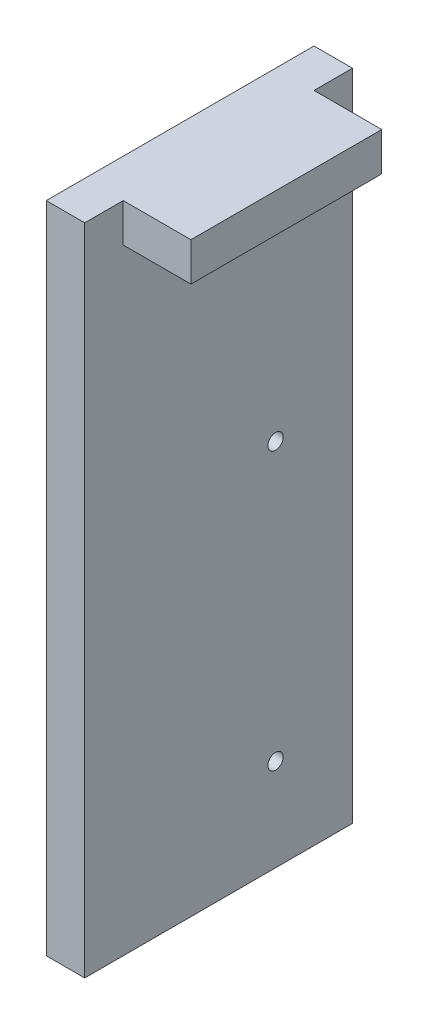
ISO-10303-21;
HEADER;
FILE_DESCRIPTION(('STEP AP214'),'2;1');
FILE_NAME('part.step','',(''),(''),'','','');
FILE_SCHEMA(('AUTOMOTIVE_DESIGN { 1 0 10303 214 1 1 1 1 }'));
ENDSEC;
DATA;
#1=APPLICATION_CONTEXT('core data for automotive mechanical design processes');
#2=APPLICATION_PROTOCOL_DEFINITION('international standard','automotive_design',2000,#1);
#3=PRODUCT_CONTEXT('',#1,'mechanical');
#4=PRODUCT('Part','Part','',(#3));
#5=PRODUCT_RELATED_PRODUCT_CATEGORY('part','',(#4));
#6=PRODUCT_DEFINITION_FORMATION('','',#4);
#7=PRODUCT_DEFINITION_CONTEXT('part definition',#1,'design');
#8=PRODUCT_DEFINITION('design','',#6,#7);
#9=PRODUCT_DEFINITION_SHAPE('','',#8);
#10=(LENGTH_UNIT() NAMED_UNIT(*) SI_UNIT(.MILLI.,.METRE.));
#11=(NAMED_UNIT(*) PLANE_ANGLE_UNIT() SI_UNIT($,.RADIAN.));
#12=(NAMED_UNIT(*) SI_UNIT($,.STERADIAN.) SOLID_ANGLE_UNIT());
#13=UNCERTAINTY_MEASURE_WITH_UNIT(LENGTH_MEASURE(1.E-05),#10,'distance_accuracy_value','');
#14=(GEOMETRIC_REPRESENTATION_CONTEXT(3) GLOBAL_UNCERTAINTY_ASSIGNED_CONTEXT((#13)) GLOBAL_UNIT_ASSIGNED_CONTEXT((#10,
#11,#12)) REPRESENTATION_CONTEXT('',''));
#15=CARTESIAN_POINT('',(0.,0.,0.));
#16=DIRECTION('',(0.,0.,1.));
#17=DIRECTION('',(1.,0.,0.));
#18=AXIS2_PLACEMENT_3D('',#15,#16,#17);
#19=CARTESIAN_POINT('',(1.5875,13.49375,-5.5245));
#20=DIRECTION('',(0.,0.,1.));
#21=DIRECTION('',(0.,-1.,0.));
#22=AXIS2_PLACEMENT_3D('',#19,#20,#21);
#23=PLANE('',#22);
#24=DIRECTION('',(0.,1.,0.));
#25=VECTOR('',#24,1.);
#26=CARTESIAN_POINT('',(0.,13.49375,-5.5245));
#27=LINE('',#26,#25);
#28=CARTESIAN_POINT('',(0.,-13.49375,-5.5245));
#29=VERTEX_POINT('',#28);
#30=CARTESIAN_POINT('',(0.,13.49375,-5.5245));
#31=VERTEX_POINT('',#30);
#32=EDGE_CURVE('E118',#29,#31,#27,.T.);
#33=ORIENTED_EDGE('',*,*,#32,.T.);
#34=DIRECTION('',(-1.,0.,0.));
#35=VECTOR('',#34,1.);
#36=CARTESIAN_POINT('',(1.5875,13.49375,-5.5245));
#37=LINE('',#36,#35);
#38=CARTESIAN_POINT('',(1.5875,13.49375,-5.5245));
#39=VERTEX_POINT('',#38);
#40=EDGE_CURVE('E11',#39,#31,#37,.T.);
#41=ORIENTED_EDGE('',*,*,#40,.F.);
#42=DIRECTION('',(0.,1.,0.));
#43=VECTOR('',#42,1.);
#44=CARTESIAN_POINT('',(1.5875,13.49375,-5.5245));
#45=LINE('',#44,#43);
#46=CARTESIAN_POINT('',(1.5875,-13.49375,-5.5245));
#47=VERTEX_POINT('',#46);
#48=EDGE_CURVE('E127',#47,#39,#45,.T.);
#49=ORIENTED_EDGE('',*,*,#48,.F.);
#50=DIRECTION('',(-1.,0.,0.));
#51=VECTOR('',#50,1.);
#52=CARTESIAN_POINT('',(1.5875,-13.49375,-5.5245));
#53=LINE('',#52,#51);
#54=EDGE_CURVE('E137',#47,#29,#53,.T.);
#55=ORIENTED_EDGE('',*,*,#54,.T.);
#56=EDGE_LOOP('',(#33,#41,#49,#55));
#57=FACE_BOUND('',#56,.T.);
#58=ADVANCED_FACE('F33',(#57),#23,.F.);
#59=CARTESIAN_POINT('',(1.5875,13.49375,5.5245));
#60=DIRECTION('',(0.,-1.,0.));
#61=DIRECTION('',(0.,0.,-1.));
#62=AXIS2_PLACEMENT_3D('',#59,#60,#61);
#63=PLANE('',#62);
#64=DIRECTION('',(0.,0.,1.));
#65=VECTOR('',#64,1.);
#66=CARTESIAN_POINT('',(0.,13.49375,5.5245));
#67=LINE('',#66,#65);
#68=CARTESIAN_POINT('',(0.,13.49375,5.5245));
#69=VERTEX_POINT('',#68);
#70=EDGE_CURVE('E121',#31,#69,#67,.T.);
#71=ORIENTED_EDGE('',*,*,#70,.T.);
#72=DIRECTION('',(-1.,0.,0.));
#73=VECTOR('',#72,1.);
#74=CARTESIAN_POINT('',(1.5875,13.49375,5.5245));
#75=LINE('',#74,#73);
#76=CARTESIAN_POINT('',(1.5875,13.49375,5.5245));
#77=VERTEX_POINT('',#76);
#78=EDGE_CURVE('E40',#77,#69,#75,.T.);
#79=ORIENTED_EDGE('',*,*,#78,.F.);
#80=DIRECTION('',(0.,0.,1.));
#81=VECTOR('',#80,1.);
#82=CARTESIAN_POINT('',(1.5875,13.49375,5.5245));
#83=LINE('',#82,#81);
#84=CARTESIAN_POINT('',(1.5875,13.49375,3.937));
#85=VERTEX_POINT('',#84);
#86=EDGE_CURVE('E130',#85,#77,#83,.T.);
#87=ORIENTED_EDGE('',*,*,#86,.F.);
#88=DIRECTION('',(-1.,0.,0.));
#89=VECTOR('',#88,1.);
#90=CARTESIAN_POINT('',(4.3815,13.49375,3.937));
#91=LINE('',#90,#89);
#92=CARTESIAN_POINT('',(4.3815,13.49375,3.937));
#93=VERTEX_POINT('',#92);
#94=EDGE_CURVE('E102',#93,#85,#91,.T.);
#95=ORIENTED_EDGE('',*,*,#94,.F.);
#96=DIRECTION('',(0.,0.,1.));
#97=VECTOR('',#96,1.);
#98=CARTESIAN_POINT('',(4.3815,13.49375,3.937));
#99=LINE('',#98,#97);
#100=CARTESIAN_POINT('',(4.3815,13.49375,-3.937));
#101=VERTEX_POINT('',#100);
#102=EDGE_CURVE('E96',#101,#93,#99,.T.);
#103=ORIENTED_EDGE('',*,*,#102,.F.);
#104=DIRECTION('',(-1.,0.,0.));
#105=VECTOR('',#104,1.);
#106=CARTESIAN_POINT('',(4.3815,13.49375,-3.937));
#107=LINE('',#106,#105);
#108=CARTESIAN_POINT('',(1.5875,13.49375,-3.937));
#109=VERTEX_POINT('',#108);
#110=EDGE_CURVE('E100',#101,#109,#107,.T.);
#111=ORIENTED_EDGE('',*,*,#110,.T.);
#112=EDGE_CURVE('E132',#39,#109,#83,.T.);
#113=ORIENTED_EDGE('',*,*,#112,.F.);
#114=ORIENTED_EDGE('',*,*,#40,.T.);
#115=EDGE_LOOP('',(#71,#79,#87,#95,#103,#111,#113,#114));
#116=FACE_BOUND('',#115,.T.);
#117=ADVANCED_FACE('F98',(#116),#63,.F.);
#118=CARTESIAN_POINT('',(1.5875,13.49375,5.5245));
#119=DIRECTION('',(0.,0.,-1.));
#120=DIRECTION('',(0.,1.,0.));
#121=AXIS2_PLACEMENT_3D('',#118,#119,#120);
#122=PLANE('',#121);
#123=DIRECTION('',(0.,-1.,0.));
#124=VECTOR('',#123,1.);
#125=CARTESIAN_POINT('',(0.,13.49375,5.5245));
#126=LINE('',#125,#124);
#127=CARTESIAN_POINT('',(0.,-13.49375,5.5245));
#128=VERTEX_POINT('',#127);
#129=EDGE_CURVE('E140',#69,#128,#126,.T.);
#130=ORIENTED_EDGE('',*,*,#129,.T.);
#131=DIRECTION('',(-1.,0.,0.));
#132=VECTOR('',#131,1.);
#133=CARTESIAN_POINT('',(1.5875,-13.49375,5.5245));
#134=LINE('',#133,#132);
#135=CARTESIAN_POINT('',(1.5875,-13.49375,5.5245));
#136=VERTEX_POINT('',#135);
#137=EDGE_CURVE('E145',#136,#128,#134,.T.);
#138=ORIENTED_EDGE('',*,*,#137,.F.);
#139=DIRECTION('',(0.,-1.,0.));
#140=VECTOR('',#139,1.);
#141=CARTESIAN_POINT('',(1.5875,13.49375,5.5245));
#142=LINE('',#141,#140);
#143=EDGE_CURVE('E134',#77,#136,#142,.T.);
#144=ORIENTED_EDGE('',*,*,#143,.F.);
#145=ORIENTED_EDGE('',*,*,#78,.T.);
#146=EDGE_LOOP('',(#130,#138,#144,#145));
#147=FACE_BOUND('',#146,.T.);
#148=ADVANCED_FACE('F152',(#147),#122,.F.);
#149=CARTESIAN_POINT('',(1.5875,-13.49375,5.5245));
#150=DIRECTION('',(0.,1.,0.));
#151=DIRECTION('',(0.,0.,1.));
#152=AXIS2_PLACEMENT_3D('',#149,#150,#151);
#153=PLANE('',#152);
#154=DIRECTION('',(0.,0.,-1.));
#155=VECTOR('',#154,1.);
#156=CARTESIAN_POINT('',(0.,-13.49375,5.5245));
#157=LINE('',#156,#155);
#158=EDGE_CURVE('E131',#128,#29,#157,.T.);
#159=ORIENTED_EDGE('',*,*,#158,.T.);
#160=ORIENTED_EDGE('',*,*,#54,.F.);
#161=DIRECTION('',(0.,0.,-1.));
#162=VECTOR('',#161,1.);
#163=CARTESIAN_POINT('',(1.5875,-13.49375,5.5245));
#164=LINE('',#163,#162);
#165=EDGE_CURVE('E136',#136,#47,#164,.T.);
#166=ORIENTED_EDGE('',*,*,#165,.F.);
#167=ORIENTED_EDGE('',*,*,#137,.T.);
#168=EDGE_LOOP('',(#159,#160,#166,#167));
#169=FACE_BOUND('',#168,.T.);
#170=ADVANCED_FACE('F160',(#169),#153,.F.);
#171=CARTESIAN_POINT('',(1.5875,0.,0.));
#172=DIRECTION('',(1.,0.,0.));
#173=DIRECTION('',(0.,0.,-1.));
#174=AXIS2_PLACEMENT_3D('',#171,#172,#173);
#175=PLANE('',#174);
#176=CARTESIAN_POINT('',(1.5875,-9.68375,-2.3495));
#177=DIRECTION('',(1.,0.,0.));
#178=DIRECTION('',(0.,0.,-1.));
#179=AXIS2_PLACEMENT_3D('',#176,#177,#178);
#180=CIRCLE('',#179,0.3175);
#181=CARTESIAN_POINT('',(1.5875,-9.68375,-2.667));
#182=VERTEX_POINT('',#181);
#183=EDGE_CURVE('E257',#182,#182,#180,.F.);
#184=ORIENTED_EDGE('',*,*,#183,.T.);
#185=EDGE_LOOP('',(#184));
#186=FACE_BOUND('',#185,.T.);
#187=CARTESIAN_POINT('',(1.5875,1.74625,-2.3495));
#188=DIRECTION('',(1.,0.,0.));
#189=DIRECTION('',(0.,0.,-1.));
#190=AXIS2_PLACEMENT_3D('',#187,#188,#189);
#191=CIRCLE('',#190,0.3175);
#192=CARTESIAN_POINT('',(1.5875,1.74625,-2.667));
#193=VERTEX_POINT('',#192);
#194=EDGE_CURVE('E261',#193,#193,#191,.F.);
#195=ORIENTED_EDGE('',*,*,#194,.T.);
#196=EDGE_LOOP('',(#195));
#197=FACE_BOUND('',#196,.T.);
#198=DIRECTION('',(0.,1.,0.));
#199=VECTOR('',#198,1.);
#200=CARTESIAN_POINT('',(1.5875,13.49375,-3.937));
#201=LINE('',#200,#199);
#202=CARTESIAN_POINT('',(1.5875,11.90625,-3.937));
#203=VERTEX_POINT('',#202);
#204=EDGE_CURVE('E47',#203,#109,#201,.T.);
#205=ORIENTED_EDGE('',*,*,#204,.F.);
#206=DIRECTION('',(0.,0.,-1.));
#207=VECTOR('',#206,1.);
#208=CARTESIAN_POINT('',(1.5875,11.90625,3.937));
#209=LINE('',#208,#207);
#210=CARTESIAN_POINT('',(1.5875,11.90625,3.937));
#211=VERTEX_POINT('',#210);
#212=EDGE_CURVE('E115',#211,#203,#209,.T.);
#213=ORIENTED_EDGE('',*,*,#212,.F.);
#214=DIRECTION('',(0.,-1.,0.));
#215=VECTOR('',#214,1.);
#216=CARTESIAN_POINT('',(1.5875,13.49375,3.937));
#217=LINE('',#216,#215);
#218=EDGE_CURVE('E53',#85,#211,#217,.T.);
#219=ORIENTED_EDGE('',*,*,#218,.F.);
#220=ORIENTED_EDGE('',*,*,#86,.T.);
#221=ORIENTED_EDGE('',*,*,#143,.T.);
#222=ORIENTED_EDGE('',*,*,#165,.T.);
#223=ORIENTED_EDGE('',*,*,#48,.T.);
#224=ORIENTED_EDGE('',*,*,#112,.T.);
#225=EDGE_LOOP('',(#205,#213,#219,#220,#221,#222,#223,#224));
#226=FACE_BOUND('',#225,.T.);
#227=ADVANCED_FACE('F165',(#186,#197,#226),#175,.T.);
#228=CARTESIAN_POINT('',(0.,0.,0.));
#229=DIRECTION('',(1.,0.,0.));
#230=DIRECTION('',(0.,0.,-1.));
#231=AXIS2_PLACEMENT_3D('',#228,#229,#230);
#232=PLANE('',#231);
#233=CARTESIAN_POINT('',(0.,-9.68375,-2.3495));
#234=DIRECTION('',(-1.,0.,0.));
#235=DIRECTION('',(0.,0.,1.));
#236=AXIS2_PLACEMENT_3D('',#233,#234,#235);
#237=CIRCLE('',#236,0.3175);
#238=CARTESIAN_POINT('',(0.,-9.68375,-2.032));
#239=VERTEX_POINT('',#238);
#240=EDGE_CURVE('E260',#239,#239,#237,.T.);
#241=ORIENTED_EDGE('',*,*,#240,.F.);
#242=EDGE_LOOP('',(#241));
#243=FACE_BOUND('',#242,.T.);
#244=CARTESIAN_POINT('',(0.,1.74625,-2.3495));
#245=DIRECTION('',(-1.,0.,0.));
#246=DIRECTION('',(0.,0.,1.));
#247=AXIS2_PLACEMENT_3D('',#244,#245,#246);
#248=CIRCLE('',#247,0.3175);
#249=CARTESIAN_POINT('',(0.,1.74625,-2.032));
#250=VERTEX_POINT('',#249);
#251=EDGE_CURVE('E175',#250,#250,#248,.T.);
#252=ORIENTED_EDGE('',*,*,#251,.F.);
#253=EDGE_LOOP('',(#252));
#254=FACE_BOUND('',#253,.T.);
#255=ORIENTED_EDGE('',*,*,#32,.F.);
#256=ORIENTED_EDGE('',*,*,#158,.F.);
#257=ORIENTED_EDGE('',*,*,#129,.F.);
#258=ORIENTED_EDGE('',*,*,#70,.F.);
#259=EDGE_LOOP('',(#255,#256,#257,#258));
#260=FACE_BOUND('',#259,.T.);
#261=ADVANCED_FACE('F157',(#243,#254,#260),#232,.F.);
#262=CARTESIAN_POINT('',(4.3815,13.49375,-3.937));
#263=DIRECTION('',(0.,0.,1.));
#264=DIRECTION('',(1.,0.,0.));
#265=AXIS2_PLACEMENT_3D('',#262,#263,#264);
#266=PLANE('',#265);
#267=ORIENTED_EDGE('',*,*,#204,.T.);
#268=ORIENTED_EDGE('',*,*,#110,.F.);
#269=DIRECTION('',(0.,1.,0.));
#270=VECTOR('',#269,1.);
#271=CARTESIAN_POINT('',(4.3815,13.49375,-3.937));
#272=LINE('',#271,#270);
#273=CARTESIAN_POINT('',(4.3815,11.90625,-3.937));
#274=VERTEX_POINT('',#273);
#275=EDGE_CURVE('E106',#274,#101,#272,.T.);
#276=ORIENTED_EDGE('',*,*,#275,.F.);
#277=DIRECTION('',(-1.,0.,0.));
#278=VECTOR('',#277,1.);
#279=CARTESIAN_POINT('',(4.3815,11.90625,-3.937));
#280=LINE('',#279,#278);
#281=EDGE_CURVE('E171',#274,#203,#280,.T.);
#282=ORIENTED_EDGE('',*,*,#281,.T.);
#283=EDGE_LOOP('',(#267,#268,#276,#282));
#284=FACE_BOUND('',#283,.T.);
#285=ADVANCED_FACE('F117',(#284),#266,.F.);
#286=CARTESIAN_POINT('',(4.3815,13.49375,3.937));
#287=DIRECTION('',(0.,0.,-1.));
#288=DIRECTION('',(-1.,0.,0.));
#289=AXIS2_PLACEMENT_3D('',#286,#287,#288);
#290=PLANE('',#289);
#291=ORIENTED_EDGE('',*,*,#218,.T.);
#292=DIRECTION('',(-1.,0.,0.));
#293=VECTOR('',#292,1.);
#294=CARTESIAN_POINT('',(4.3815,11.90625,3.937));
#295=LINE('',#294,#293);
#296=CARTESIAN_POINT('',(4.3815,11.90625,3.937));
#297=VERTEX_POINT('',#296);
#298=EDGE_CURVE('E123',#297,#211,#295,.T.);
#299=ORIENTED_EDGE('',*,*,#298,.F.);
#300=DIRECTION('',(0.,-1.,0.));
#301=VECTOR('',#300,1.);
#302=CARTESIAN_POINT('',(4.3815,13.49375,3.937));
#303=LINE('',#302,#301);
#304=EDGE_CURVE('E105',#93,#297,#303,.T.);
#305=ORIENTED_EDGE('',*,*,#304,.F.);
#306=ORIENTED_EDGE('',*,*,#94,.T.);
#307=EDGE_LOOP('',(#291,#299,#305,#306));
#308=FACE_BOUND('',#307,.T.);
#309=ADVANCED_FACE('F167',(#308),#290,.F.);
#310=CARTESIAN_POINT('',(4.3815,11.90625,3.937));
#311=DIRECTION('',(0.,1.,0.));
#312=DIRECTION('',(0.,0.,1.));
#313=AXIS2_PLACEMENT_3D('',#310,#311,#312);
#314=PLANE('',#313);
#315=ORIENTED_EDGE('',*,*,#212,.T.);
#316=ORIENTED_EDGE('',*,*,#281,.F.);
#317=DIRECTION('',(0.,0.,-1.));
#318=VECTOR('',#317,1.);
#319=CARTESIAN_POINT('',(4.3815,11.90625,3.937));
#320=LINE('',#319,#318);
#321=EDGE_CURVE('E111',#297,#274,#320,.T.);
#322=ORIENTED_EDGE('',*,*,#321,.F.);
#323=ORIENTED_EDGE('',*,*,#298,.T.);
#324=EDGE_LOOP('',(#315,#316,#322,#323));
#325=FACE_BOUND('',#324,.T.);
#326=ADVANCED_FACE('F179',(#325),#314,.F.);
#327=CARTESIAN_POINT('',(4.3815,0.,0.));
#328=DIRECTION('',(1.,0.,0.));
#329=DIRECTION('',(0.,0.,-1.));
#330=AXIS2_PLACEMENT_3D('',#327,#328,#329);
#331=PLANE('',#330);
#332=ORIENTED_EDGE('',*,*,#275,.T.);
#333=ORIENTED_EDGE('',*,*,#102,.T.);
#334=ORIENTED_EDGE('',*,*,#304,.T.);
#335=ORIENTED_EDGE('',*,*,#321,.T.);
#336=EDGE_LOOP('',(#332,#333,#334,#335));
#337=FACE_BOUND('',#336,.T.);
#338=ADVANCED_FACE('F109',(#337),#331,.T.);
#339=CARTESIAN_POINT('',(4.3825,1.74625,-2.3495));
#340=DIRECTION('',(-1.,0.,0.));
#341=DIRECTION('',(0.,0.,1.));
#342=AXIS2_PLACEMENT_3D('',#339,#340,#341);
#343=CYLINDRICAL_SURFACE('',#342,0.3175);
#344=ORIENTED_EDGE('',*,*,#194,.F.);
#345=EDGE_LOOP('',(#344));
#346=FACE_BOUND('',#345,.T.);
#347=ORIENTED_EDGE('',*,*,#251,.T.);
#348=EDGE_LOOP('',(#347));
#349=FACE_BOUND('',#348,.T.);
#350=ADVANCED_FACE('F186',(#346,#349),#343,.F.);
#351=CARTESIAN_POINT('',(4.3825,-9.68375,-2.3495));
#352=DIRECTION('',(-1.,0.,0.));
#353=DIRECTION('',(0.,0.,1.));
#354=AXIS2_PLACEMENT_3D('',#351,#352,#353);
#355=CYLINDRICAL_SURFACE('',#354,0.3175);
#356=ORIENTED_EDGE('',*,*,#183,.F.);
#357=EDGE_LOOP('',(#356));
#358=FACE_BOUND('',#357,.T.);
#359=ORIENTED_EDGE('',*,*,#240,.T.);
#360=EDGE_LOOP('',(#359));
#361=FACE_BOUND('',#360,.T.);
#362=ADVANCED_FACE('F240',(#358,#361),#355,.F.);
#363=CLOSED_SHELL('',(#58,#117,#148,#170,#227,#261,#285,#309,#326,#338,#350,#362));
#364=MANIFOLD_SOLID_BREP('B2',#363);
#365=ADVANCED_BREP_SHAPE_REPRESENTATION('',(#18,#364),#14);
#366=SHAPE_DEFINITION_REPRESENTATION(#9,#365);
ENDSEC;
END-ISO-10303-21;
